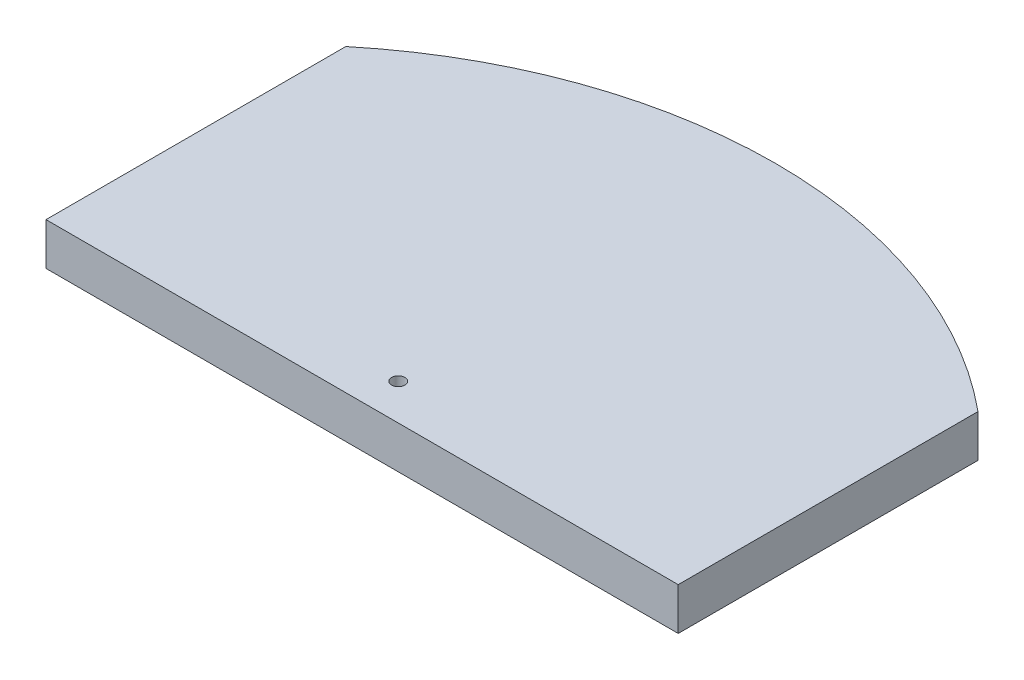
ISO-10303-21;
HEADER;
FILE_DESCRIPTION(('STEP AP214'),'2;1');
FILE_NAME('part.step','',(''),(''),'','','');
FILE_SCHEMA(('AUTOMOTIVE_DESIGN { 1 0 10303 214 1 1 1 1 }'));
ENDSEC;
DATA;
#1=APPLICATION_CONTEXT('core data for automotive mechanical design processes');
#2=APPLICATION_PROTOCOL_DEFINITION('international standard','automotive_design',2000,#1);
#3=PRODUCT_CONTEXT('',#1,'mechanical');
#4=PRODUCT('Part','Part','',(#3));
#5=PRODUCT_RELATED_PRODUCT_CATEGORY('part','',(#4));
#6=PRODUCT_DEFINITION_FORMATION('','',#4);
#7=PRODUCT_DEFINITION_CONTEXT('part definition',#1,'design');
#8=PRODUCT_DEFINITION('design','',#6,#7);
#9=PRODUCT_DEFINITION_SHAPE('','',#8);
#10=(LENGTH_UNIT() NAMED_UNIT(*) SI_UNIT(.MILLI.,.METRE.));
#11=(NAMED_UNIT(*) PLANE_ANGLE_UNIT() SI_UNIT($,.RADIAN.));
#12=(NAMED_UNIT(*) SI_UNIT($,.STERADIAN.) SOLID_ANGLE_UNIT());
#13=UNCERTAINTY_MEASURE_WITH_UNIT(LENGTH_MEASURE(1.E-05),#10,'distance_accuracy_value','');
#14=(GEOMETRIC_REPRESENTATION_CONTEXT(3) GLOBAL_UNCERTAINTY_ASSIGNED_CONTEXT((#13)) GLOBAL_UNIT_ASSIGNED_CONTEXT((#10,
#11,#12)) REPRESENTATION_CONTEXT('',''));
#15=CARTESIAN_POINT('',(0.,0.,0.));
#16=DIRECTION('',(0.,0.,1.));
#17=DIRECTION('',(1.,0.,0.));
#18=AXIS2_PLACEMENT_3D('',#15,#16,#17);
#19=CARTESIAN_POINT('',(0.,6.35,89.1200773529188));
#20=DIRECTION('',(0.,-1.,0.));
#21=DIRECTION('',(0.,0.,-1.));
#22=AXIS2_PLACEMENT_3D('',#19,#20,#21);
#23=PLANE('',#22);
#24=CARTESIAN_POINT('',(0.,6.35,89.1200773529188));
#25=DIRECTION('',(0.,1.,0.));
#26=DIRECTION('',(0.,0.,-1.));
#27=AXIS2_PLACEMENT_3D('',#24,#25,#26);
#28=CIRCLE('',#27,74.5);
#29=CARTESIAN_POINT('',(47.45,6.35,31.6853535353535));
#30=VERTEX_POINT('',#29);
#31=CARTESIAN_POINT('',(-47.45,6.35,31.6853535353535));
#32=VERTEX_POINT('',#31);
#33=EDGE_CURVE('E91',#30,#32,#28,.T.);
#34=ORIENTED_EDGE('',*,*,#33,.T.);
#35=DIRECTION('',(0.,0.,1.));
#36=VECTOR('',#35,1.);
#37=CARTESIAN_POINT('',(-47.45,6.35,31.6853535353535));
#38=LINE('',#37,#36);
#39=CARTESIAN_POINT('',(-47.45,6.35,76.6853535353535));
#40=VERTEX_POINT('',#39);
#41=EDGE_CURVE('E86',#32,#40,#38,.T.);
#42=ORIENTED_EDGE('',*,*,#41,.T.);
#43=DIRECTION('',(1.,0.,0.));
#44=VECTOR('',#43,1.);
#45=CARTESIAN_POINT('',(-47.45,6.35,76.6853535353535));
#46=LINE('',#45,#44);
#47=CARTESIAN_POINT('',(47.45,6.35,76.6853535353535));
#48=VERTEX_POINT('',#47);
#49=EDGE_CURVE('E89',#40,#48,#46,.T.);
#50=ORIENTED_EDGE('',*,*,#49,.T.);
#51=DIRECTION('',(0.,0.,-1.));
#52=VECTOR('',#51,1.);
#53=CARTESIAN_POINT('',(47.45,6.35,31.6853535353535));
#54=LINE('',#53,#52);
#55=EDGE_CURVE('E56',#48,#30,#54,.T.);
#56=ORIENTED_EDGE('',*,*,#55,.T.);
#57=EDGE_LOOP('',(#34,#42,#50,#56));
#58=FACE_BOUND('',#57,.T.);
#59=CARTESIAN_POINT('',(0.,6.35,71.260285785023));
#60=DIRECTION('',(0.,1.,0.));
#61=DIRECTION('',(0.,0.,1.));
#62=AXIS2_PLACEMENT_3D('',#59,#60,#61);
#63=CIRCLE('',#62,1.);
#64=CARTESIAN_POINT('',(0.,6.35,72.260285785023));
#65=VERTEX_POINT('',#64);
#66=EDGE_CURVE('E106',#65,#65,#63,.T.);
#67=ORIENTED_EDGE('',*,*,#66,.F.);
#68=EDGE_LOOP('',(#67));
#69=FACE_BOUND('',#68,.T.);
#70=ADVANCED_FACE('F39',(#58,#69),#23,.F.);
#71=CARTESIAN_POINT('',(0.,0.,89.1200773529188));
#72=DIRECTION('',(0.,-1.,0.));
#73=DIRECTION('',(0.,0.,-1.));
#74=AXIS2_PLACEMENT_3D('',#71,#72,#73);
#75=PLANE('',#74);
#76=CARTESIAN_POINT('',(0.,0.,89.1200773529188));
#77=DIRECTION('',(0.,1.,0.));
#78=DIRECTION('',(0.,0.,-1.));
#79=AXIS2_PLACEMENT_3D('',#76,#77,#78);
#80=CIRCLE('',#79,74.5);
#81=CARTESIAN_POINT('',(47.45,0.,31.6853535353535));
#82=VERTEX_POINT('',#81);
#83=CARTESIAN_POINT('',(-47.45,0.,31.6853535353535));
#84=VERTEX_POINT('',#83);
#85=EDGE_CURVE('E103',#82,#84,#80,.T.);
#86=ORIENTED_EDGE('',*,*,#85,.F.);
#87=DIRECTION('',(0.,0.,-1.));
#88=VECTOR('',#87,1.);
#89=CARTESIAN_POINT('',(47.45,0.,31.6853535353535));
#90=LINE('',#89,#88);
#91=CARTESIAN_POINT('',(47.45,0.,76.6853535353535));
#92=VERTEX_POINT('',#91);
#93=EDGE_CURVE('E79',#92,#82,#90,.T.);
#94=ORIENTED_EDGE('',*,*,#93,.F.);
#95=DIRECTION('',(1.,0.,0.));
#96=VECTOR('',#95,1.);
#97=CARTESIAN_POINT('',(-47.45,0.,76.6853535353535));
#98=LINE('',#97,#96);
#99=CARTESIAN_POINT('',(-47.45,0.,76.6853535353535));
#100=VERTEX_POINT('',#99);
#101=EDGE_CURVE('E73',#100,#92,#98,.T.);
#102=ORIENTED_EDGE('',*,*,#101,.F.);
#103=DIRECTION('',(0.,0.,1.));
#104=VECTOR('',#103,1.);
#105=CARTESIAN_POINT('',(-47.45,0.,31.6853535353535));
#106=LINE('',#105,#104);
#107=EDGE_CURVE('E95',#84,#100,#106,.T.);
#108=ORIENTED_EDGE('',*,*,#107,.F.);
#109=EDGE_LOOP('',(#86,#94,#102,#108));
#110=FACE_BOUND('',#109,.T.);
#111=CARTESIAN_POINT('',(0.,0.,71.260285785023));
#112=DIRECTION('',(0.,1.,0.));
#113=DIRECTION('',(0.,0.,1.));
#114=AXIS2_PLACEMENT_3D('',#111,#112,#113);
#115=CIRCLE('',#114,1.);
#116=CARTESIAN_POINT('',(0.,0.,72.260285785023));
#117=VERTEX_POINT('',#116);
#118=EDGE_CURVE('E118',#117,#117,#115,.T.);
#119=ORIENTED_EDGE('',*,*,#118,.T.);
#120=EDGE_LOOP('',(#119));
#121=FACE_BOUND('',#120,.T.);
#122=ADVANCED_FACE('F114',(#110,#121),#75,.T.);
#123=CARTESIAN_POINT('',(0.,6.35,89.1200773529188));
#124=DIRECTION('',(0.,-1.,0.));
#125=DIRECTION('',(0.,0.,-1.));
#126=AXIS2_PLACEMENT_3D('',#123,#124,#125);
#127=CYLINDRICAL_SURFACE('',#126,74.5);
#128=ORIENTED_EDGE('',*,*,#85,.T.);
#129=DIRECTION('',(0.,-1.,0.));
#130=VECTOR('',#129,1.);
#131=CARTESIAN_POINT('',(-47.45,6.35,31.6853535353535));
#132=LINE('',#131,#130);
#133=EDGE_CURVE('E11',#32,#84,#132,.T.);
#134=ORIENTED_EDGE('',*,*,#133,.F.);
#135=ORIENTED_EDGE('',*,*,#33,.F.);
#136=DIRECTION('',(0.,-1.,0.));
#137=VECTOR('',#136,1.);
#138=CARTESIAN_POINT('',(47.45,6.35,31.6853535353535));
#139=LINE('',#138,#137);
#140=EDGE_CURVE('E99',#30,#82,#139,.T.);
#141=ORIENTED_EDGE('',*,*,#140,.T.);
#142=EDGE_LOOP('',(#128,#134,#135,#141));
#143=FACE_BOUND('',#142,.T.);
#144=ADVANCED_FACE('F41',(#143),#127,.T.);
#145=CARTESIAN_POINT('',(-47.45,6.35,31.6853535353535));
#146=DIRECTION('',(1.,0.,0.));
#147=DIRECTION('',(0.,0.,-1.));
#148=AXIS2_PLACEMENT_3D('',#145,#146,#147);
#149=PLANE('',#148);
#150=ORIENTED_EDGE('',*,*,#107,.T.);
#151=DIRECTION('',(0.,-1.,0.));
#152=VECTOR('',#151,1.);
#153=CARTESIAN_POINT('',(-47.45,6.35,76.6853535353535));
#154=LINE('',#153,#152);
#155=EDGE_CURVE('E48',#40,#100,#154,.T.);
#156=ORIENTED_EDGE('',*,*,#155,.F.);
#157=ORIENTED_EDGE('',*,*,#41,.F.);
#158=ORIENTED_EDGE('',*,*,#133,.T.);
#159=EDGE_LOOP('',(#150,#156,#157,#158));
#160=FACE_BOUND('',#159,.T.);
#161=ADVANCED_FACE('F94',(#160),#149,.F.);
#162=CARTESIAN_POINT('',(-47.45,6.35,76.6853535353535));
#163=DIRECTION('',(0.,0.,-1.));
#164=DIRECTION('',(-1.,0.,0.));
#165=AXIS2_PLACEMENT_3D('',#162,#163,#164);
#166=PLANE('',#165);
#167=ORIENTED_EDGE('',*,*,#101,.T.);
#168=DIRECTION('',(0.,-1.,0.));
#169=VECTOR('',#168,1.);
#170=CARTESIAN_POINT('',(47.45,6.35,76.6853535353535));
#171=LINE('',#170,#169);
#172=EDGE_CURVE('E96',#48,#92,#171,.T.);
#173=ORIENTED_EDGE('',*,*,#172,.F.);
#174=ORIENTED_EDGE('',*,*,#49,.F.);
#175=ORIENTED_EDGE('',*,*,#155,.T.);
#176=EDGE_LOOP('',(#167,#173,#174,#175));
#177=FACE_BOUND('',#176,.T.);
#178=ADVANCED_FACE('F97',(#177),#166,.F.);
#179=CARTESIAN_POINT('',(47.45,6.35,31.6853535353535));
#180=DIRECTION('',(-1.,0.,0.));
#181=DIRECTION('',(0.,0.,1.));
#182=AXIS2_PLACEMENT_3D('',#179,#180,#181);
#183=PLANE('',#182);
#184=ORIENTED_EDGE('',*,*,#93,.T.);
#185=ORIENTED_EDGE('',*,*,#140,.F.);
#186=ORIENTED_EDGE('',*,*,#55,.F.);
#187=ORIENTED_EDGE('',*,*,#172,.T.);
#188=EDGE_LOOP('',(#184,#185,#186,#187));
#189=FACE_BOUND('',#188,.T.);
#190=ADVANCED_FACE('F111',(#189),#183,.F.);
#191=CARTESIAN_POINT('',(0.,6.35,71.260285785023));
#192=DIRECTION('',(0.,-1.,0.));
#193=DIRECTION('',(0.,0.,-1.));
#194=AXIS2_PLACEMENT_3D('',#191,#192,#193);
#195=CYLINDRICAL_SURFACE('',#194,1.);
#196=ORIENTED_EDGE('',*,*,#66,.T.);
#197=EDGE_LOOP('',(#196));
#198=FACE_BOUND('',#197,.T.);
#199=ORIENTED_EDGE('',*,*,#118,.F.);
#200=EDGE_LOOP('',(#199));
#201=FACE_BOUND('',#200,.T.);
#202=ADVANCED_FACE('F124',(#198,#201),#195,.F.);
#203=CLOSED_SHELL('',(#70,#122,#144,#161,#178,#190,#202));
#204=MANIFOLD_SOLID_BREP('B2',#203);
#205=ADVANCED_BREP_SHAPE_REPRESENTATION('',(#18,#204),#14);
#206=SHAPE_DEFINITION_REPRESENTATION(#9,#205);
ENDSEC;
END-ISO-10303-21;
